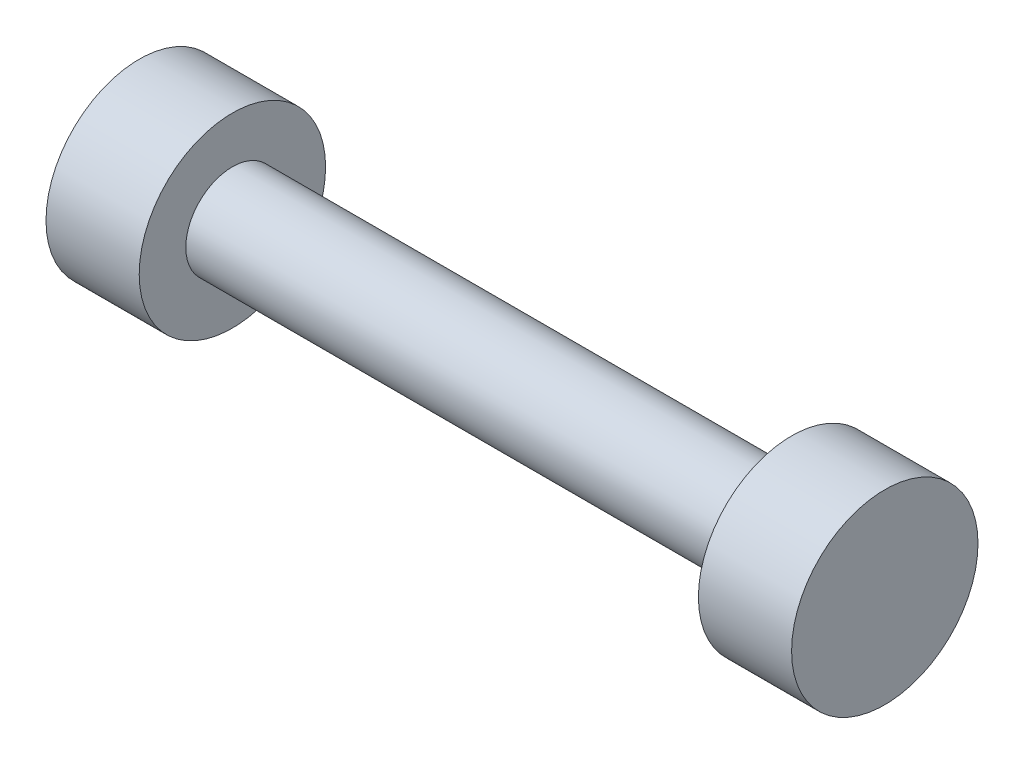
ISO-10303-21;
HEADER;
FILE_DESCRIPTION(('STEP AP214'),'2;1');
FILE_NAME('part.step','',(''),(''),'','','');
FILE_SCHEMA(('AUTOMOTIVE_DESIGN { 1 0 10303 214 1 1 1 1 }'));
ENDSEC;
DATA;
#1=APPLICATION_CONTEXT('core data for automotive mechanical design processes');
#2=APPLICATION_PROTOCOL_DEFINITION('international standard','automotive_design',2000,#1);
#3=PRODUCT_CONTEXT('',#1,'mechanical');
#4=PRODUCT('Part','Part','',(#3));
#5=PRODUCT_RELATED_PRODUCT_CATEGORY('part','',(#4));
#6=PRODUCT_DEFINITION_FORMATION('','',#4);
#7=PRODUCT_DEFINITION_CONTEXT('part definition',#1,'design');
#8=PRODUCT_DEFINITION('design','',#6,#7);
#9=PRODUCT_DEFINITION_SHAPE('','',#8);
#10=(LENGTH_UNIT() NAMED_UNIT(*) SI_UNIT(.MILLI.,.METRE.));
#11=(NAMED_UNIT(*) PLANE_ANGLE_UNIT() SI_UNIT($,.RADIAN.));
#12=(NAMED_UNIT(*) SI_UNIT($,.STERADIAN.) SOLID_ANGLE_UNIT());
#13=UNCERTAINTY_MEASURE_WITH_UNIT(LENGTH_MEASURE(1.E-05),#10,'distance_accuracy_value','');
#14=(GEOMETRIC_REPRESENTATION_CONTEXT(3) GLOBAL_UNCERTAINTY_ASSIGNED_CONTEXT((#13)) GLOBAL_UNIT_ASSIGNED_CONTEXT((#10,
#11,#12)) REPRESENTATION_CONTEXT('',''));
#15=CARTESIAN_POINT('',(0.,0.,0.));
#16=DIRECTION('',(0.,0.,1.));
#17=DIRECTION('',(1.,0.,0.));
#18=AXIS2_PLACEMENT_3D('',#15,#16,#17);
#19=CARTESIAN_POINT('',(-39.5020185079272,0.,0.));
#20=DIRECTION('',(-1.,0.,0.));
#21=DIRECTION('',(0.,0.,1.));
#22=AXIS2_PLACEMENT_3D('',#19,#20,#21);
#23=CYLINDRICAL_SURFACE('',#22,2.5);
#24=CARTESIAN_POINT('',(-15.,0.,0.));
#25=DIRECTION('',(-1.,0.,0.));
#26=DIRECTION('',(0.,0.,1.));
#27=AXIS2_PLACEMENT_3D('',#24,#25,#26);
#28=CIRCLE('',#27,2.49999999999999);
#29=CARTESIAN_POINT('',(-15.,0.,2.49999999999998));
#30=VERTEX_POINT('',#29);
#31=EDGE_CURVE('E10',#30,#30,#28,.T.);
#32=ORIENTED_EDGE('',*,*,#31,.F.);
#33=EDGE_LOOP('',(#32));
#34=FACE_BOUND('',#33,.T.);
#35=CARTESIAN_POINT('',(15.,0.,0.));
#36=DIRECTION('',(-1.,0.,0.));
#37=DIRECTION('',(0.,0.,1.));
#38=AXIS2_PLACEMENT_3D('',#35,#36,#37);
#39=CIRCLE('',#38,2.5);
#40=CARTESIAN_POINT('',(15.,0.,2.5));
#41=VERTEX_POINT('',#40);
#42=EDGE_CURVE('E52',#41,#41,#39,.T.);
#43=ORIENTED_EDGE('',*,*,#42,.T.);
#44=EDGE_LOOP('',(#43));
#45=FACE_BOUND('',#44,.T.);
#46=ADVANCED_FACE('F30',(#34,#45),#23,.T.);
#47=CARTESIAN_POINT('',(-15.,0.,-2.5));
#48=DIRECTION('',(-1.,0.,0.));
#49=DIRECTION('',(0.,0.,1.));
#50=AXIS2_PLACEMENT_3D('',#47,#48,#49);
#51=PLANE('',#50);
#52=CARTESIAN_POINT('',(-15.,0.,0.));
#53=DIRECTION('',(-1.,0.,0.));
#54=DIRECTION('',(0.,0.,1.));
#55=AXIS2_PLACEMENT_3D('',#52,#53,#54);
#56=CIRCLE('',#55,4.99999999999999);
#57=CARTESIAN_POINT('',(-15.,0.,4.99999999999998));
#58=VERTEX_POINT('',#57);
#59=EDGE_CURVE('E36',#58,#58,#56,.T.);
#60=ORIENTED_EDGE('',*,*,#59,.F.);
#61=EDGE_LOOP('',(#60));
#62=FACE_BOUND('',#61,.T.);
#63=ORIENTED_EDGE('',*,*,#31,.T.);
#64=EDGE_LOOP('',(#63));
#65=FACE_BOUND('',#64,.T.);
#66=ADVANCED_FACE('F80',(#62,#65),#51,.F.);
#67=CARTESIAN_POINT('',(-39.5020185079272,0.,0.));
#68=DIRECTION('',(-1.,0.,0.));
#69=DIRECTION('',(0.,0.,1.));
#70=AXIS2_PLACEMENT_3D('',#67,#68,#69);
#71=CYLINDRICAL_SURFACE('',#70,4.99999999999999);
#72=CARTESIAN_POINT('',(-20.,0.,0.));
#73=DIRECTION('',(-1.,0.,0.));
#74=DIRECTION('',(0.,0.,1.));
#75=AXIS2_PLACEMENT_3D('',#72,#73,#74);
#76=CIRCLE('',#75,4.99999999999999);
#77=CARTESIAN_POINT('',(-20.,0.,4.99999999999998));
#78=VERTEX_POINT('',#77);
#79=EDGE_CURVE('E40',#78,#78,#76,.T.);
#80=ORIENTED_EDGE('',*,*,#79,.F.);
#81=EDGE_LOOP('',(#80));
#82=FACE_BOUND('',#81,.T.);
#83=ORIENTED_EDGE('',*,*,#59,.T.);
#84=EDGE_LOOP('',(#83));
#85=FACE_BOUND('',#84,.T.);
#86=ADVANCED_FACE('F76',(#82,#85),#71,.T.);
#87=CARTESIAN_POINT('',(-20.,0.,0.));
#88=DIRECTION('',(1.,0.,0.));
#89=DIRECTION('',(0.,0.,-1.));
#90=AXIS2_PLACEMENT_3D('',#87,#88,#89);
#91=PLANE('',#90);
#92=ORIENTED_EDGE('',*,*,#79,.T.);
#93=EDGE_LOOP('',(#92));
#94=FACE_BOUND('',#93,.T.);
#95=ADVANCED_FACE('F71',(#94),#91,.F.);
#96=CARTESIAN_POINT('',(20.,0.,0.));
#97=DIRECTION('',(-1.,0.,0.));
#98=DIRECTION('',(0.,0.,1.));
#99=AXIS2_PLACEMENT_3D('',#96,#97,#98);
#100=PLANE('',#99);
#101=CARTESIAN_POINT('',(20.,0.,0.));
#102=DIRECTION('',(-1.,0.,0.));
#103=DIRECTION('',(0.,0.,1.));
#104=AXIS2_PLACEMENT_3D('',#101,#102,#103);
#105=CIRCLE('',#104,5.);
#106=CARTESIAN_POINT('',(20.,0.,5.));
#107=VERTEX_POINT('',#106);
#108=EDGE_CURVE('E44',#107,#107,#105,.T.);
#109=ORIENTED_EDGE('',*,*,#108,.F.);
#110=EDGE_LOOP('',(#109));
#111=FACE_BOUND('',#110,.T.);
#112=ADVANCED_FACE('F66',(#111),#100,.F.);
#113=CARTESIAN_POINT('',(-39.5020185079272,0.,0.));
#114=DIRECTION('',(-1.,0.,0.));
#115=DIRECTION('',(0.,0.,1.));
#116=AXIS2_PLACEMENT_3D('',#113,#114,#115);
#117=CYLINDRICAL_SURFACE('',#116,5.);
#118=CARTESIAN_POINT('',(15.,0.,0.));
#119=DIRECTION('',(-1.,0.,0.));
#120=DIRECTION('',(0.,0.,1.));
#121=AXIS2_PLACEMENT_3D('',#118,#119,#120);
#122=CIRCLE('',#121,5.);
#123=CARTESIAN_POINT('',(15.,0.,5.));
#124=VERTEX_POINT('',#123);
#125=EDGE_CURVE('E49',#124,#124,#122,.T.);
#126=ORIENTED_EDGE('',*,*,#125,.F.);
#127=EDGE_LOOP('',(#126));
#128=FACE_BOUND('',#127,.T.);
#129=ORIENTED_EDGE('',*,*,#108,.T.);
#130=EDGE_LOOP('',(#129));
#131=FACE_BOUND('',#130,.T.);
#132=ADVANCED_FACE('F60',(#128,#131),#117,.T.);
#133=CARTESIAN_POINT('',(15.,0.,-2.50000000000001));
#134=DIRECTION('',(1.,0.,0.));
#135=DIRECTION('',(0.,0.,-1.));
#136=AXIS2_PLACEMENT_3D('',#133,#134,#135);
#137=PLANE('',#136);
#138=ORIENTED_EDGE('',*,*,#42,.F.);
#139=EDGE_LOOP('',(#138));
#140=FACE_BOUND('',#139,.T.);
#141=ORIENTED_EDGE('',*,*,#125,.T.);
#142=EDGE_LOOP('',(#141));
#143=FACE_BOUND('',#142,.T.);
#144=ADVANCED_FACE('F57',(#140,#143),#137,.F.);
#145=CLOSED_SHELL('',(#46,#66,#86,#95,#112,#132,#144));
#146=MANIFOLD_SOLID_BREP('B2',#145);
#147=ADVANCED_BREP_SHAPE_REPRESENTATION('',(#18,#146),#14);
#148=SHAPE_DEFINITION_REPRESENTATION(#9,#147);
ENDSEC;
END-ISO-10303-21;
